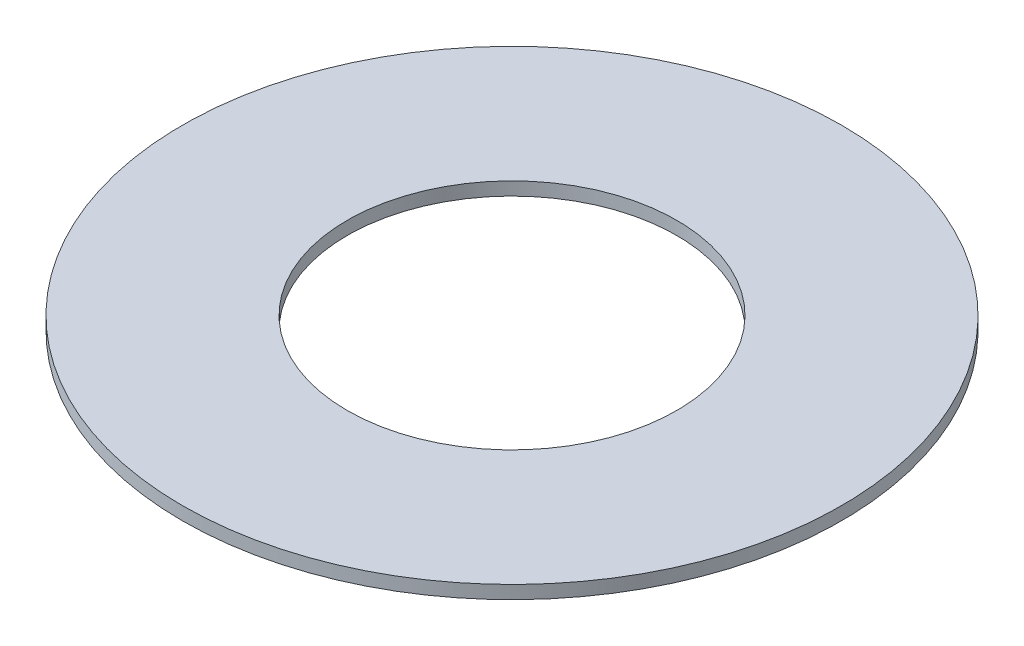
ISO-10303-21;
HEADER;
FILE_DESCRIPTION(('STEP AP214'),'2;1');
FILE_NAME('part.step','',(''),(''),'','','');
FILE_SCHEMA(('AUTOMOTIVE_DESIGN { 1 0 10303 214 1 1 1 1 }'));
ENDSEC;
DATA;
#1=APPLICATION_CONTEXT('core data for automotive mechanical design processes');
#2=APPLICATION_PROTOCOL_DEFINITION('international standard','automotive_design',2000,#1);
#3=PRODUCT_CONTEXT('',#1,'mechanical');
#4=PRODUCT('Part','Part','',(#3));
#5=PRODUCT_RELATED_PRODUCT_CATEGORY('part','',(#4));
#6=PRODUCT_DEFINITION_FORMATION('','',#4);
#7=PRODUCT_DEFINITION_CONTEXT('part definition',#1,'design');
#8=PRODUCT_DEFINITION('design','',#6,#7);
#9=PRODUCT_DEFINITION_SHAPE('','',#8);
#10=(LENGTH_UNIT() NAMED_UNIT(*) SI_UNIT(.MILLI.,.METRE.));
#11=(NAMED_UNIT(*) PLANE_ANGLE_UNIT() SI_UNIT($,.RADIAN.));
#12=(NAMED_UNIT(*) SI_UNIT($,.STERADIAN.) SOLID_ANGLE_UNIT());
#13=UNCERTAINTY_MEASURE_WITH_UNIT(LENGTH_MEASURE(1.E-05),#10,'distance_accuracy_value','');
#14=(GEOMETRIC_REPRESENTATION_CONTEXT(3) GLOBAL_UNCERTAINTY_ASSIGNED_CONTEXT((#13)) GLOBAL_UNIT_ASSIGNED_CONTEXT((#10,
#11,#12)) REPRESENTATION_CONTEXT('',''));
#15=CARTESIAN_POINT('',(0.,0.,0.));
#16=DIRECTION('',(0.,0.,1.));
#17=DIRECTION('',(1.,0.,0.));
#18=AXIS2_PLACEMENT_3D('',#15,#16,#17);
#19=CARTESIAN_POINT('',(0.,0.200000000000006,0.));
#20=DIRECTION('',(0.,1.,0.));
#21=DIRECTION('',(0.,0.,1.));
#22=AXIS2_PLACEMENT_3D('',#19,#20,#21);
#23=PLANE('',#22);
#24=CARTESIAN_POINT('',(0.,0.200000000000006,0.));
#25=DIRECTION('',(0.,-1.,0.));
#26=DIRECTION('',(0.,0.,-1.));
#27=AXIS2_PLACEMENT_3D('',#24,#25,#26);
#28=CIRCLE('',#27,5.);
#29=CARTESIAN_POINT('',(0.,0.200000000000006,-5.));
#30=VERTEX_POINT('',#29);
#31=EDGE_CURVE('E26',#30,#30,#28,.T.);
#32=ORIENTED_EDGE('',*,*,#31,.F.);
#33=EDGE_LOOP('',(#32));
#34=FACE_BOUND('',#33,.T.);
#35=CARTESIAN_POINT('',(0.,0.200000000000006,0.));
#36=DIRECTION('',(0.,1.,0.));
#37=DIRECTION('',(0.,0.,1.));
#38=AXIS2_PLACEMENT_3D('',#35,#36,#37);
#39=CIRCLE('',#38,2.5);
#40=CARTESIAN_POINT('',(0.,0.200000000000006,2.5));
#41=VERTEX_POINT('',#40);
#42=EDGE_CURVE('E17',#41,#41,#39,.F.);
#43=ORIENTED_EDGE('',*,*,#42,.T.);
#44=EDGE_LOOP('',(#43));
#45=FACE_BOUND('',#44,.T.);
#46=ADVANCED_FACE('F14',(#34,#45),#23,.T.);
#47=CARTESIAN_POINT('',(0.,0.,0.));
#48=DIRECTION('',(0.,1.,0.));
#49=DIRECTION('',(0.,0.,1.));
#50=AXIS2_PLACEMENT_3D('',#47,#48,#49);
#51=CYLINDRICAL_SURFACE('',#50,2.5);
#52=CARTESIAN_POINT('',(0.,0.,0.));
#53=DIRECTION('',(0.,1.,0.));
#54=DIRECTION('',(0.,0.,1.));
#55=AXIS2_PLACEMENT_3D('',#52,#53,#54);
#56=CIRCLE('',#55,2.5);
#57=CARTESIAN_POINT('',(0.,0.,2.5));
#58=VERTEX_POINT('',#57);
#59=EDGE_CURVE('E21',#58,#58,#56,.F.);
#60=ORIENTED_EDGE('',*,*,#59,.T.);
#61=EDGE_LOOP('',(#60));
#62=FACE_BOUND('',#61,.T.);
#63=ORIENTED_EDGE('',*,*,#42,.F.);
#64=EDGE_LOOP('',(#63));
#65=FACE_BOUND('',#64,.T.);
#66=ADVANCED_FACE('F35',(#62,#65),#51,.F.);
#67=CARTESIAN_POINT('',(0.,0.200000000000006,0.));
#68=DIRECTION('',(0.,-1.,0.));
#69=DIRECTION('',(0.,0.,-1.));
#70=AXIS2_PLACEMENT_3D('',#67,#68,#69);
#71=CYLINDRICAL_SURFACE('',#70,5.);
#72=ORIENTED_EDGE('',*,*,#31,.T.);
#73=EDGE_LOOP('',(#72));
#74=FACE_BOUND('',#73,.T.);
#75=CARTESIAN_POINT('',(0.,0.,0.));
#76=DIRECTION('',(0.,-1.,0.));
#77=DIRECTION('',(0.,0.,-1.));
#78=AXIS2_PLACEMENT_3D('',#75,#76,#77);
#79=CIRCLE('',#78,5.);
#80=CARTESIAN_POINT('',(0.,0.,-5.));
#81=VERTEX_POINT('',#80);
#82=EDGE_CURVE('E10',#81,#81,#79,.F.);
#83=ORIENTED_EDGE('',*,*,#82,.T.);
#84=EDGE_LOOP('',(#83));
#85=FACE_BOUND('',#84,.T.);
#86=ADVANCED_FACE('F37',(#74,#85),#71,.T.);
#87=CARTESIAN_POINT('',(0.,0.,0.));
#88=DIRECTION('',(0.,1.,0.));
#89=DIRECTION('',(0.,0.,1.));
#90=AXIS2_PLACEMENT_3D('',#87,#88,#89);
#91=PLANE('',#90);
#92=ORIENTED_EDGE('',*,*,#82,.F.);
#93=EDGE_LOOP('',(#92));
#94=FACE_BOUND('',#93,.T.);
#95=ORIENTED_EDGE('',*,*,#59,.F.);
#96=EDGE_LOOP('',(#95));
#97=FACE_BOUND('',#96,.T.);
#98=ADVANCED_FACE('F44',(#94,#97),#91,.F.);
#99=CLOSED_SHELL('',(#46,#66,#86,#98));
#100=MANIFOLD_SOLID_BREP('B1',#99);
#101=ADVANCED_BREP_SHAPE_REPRESENTATION('',(#18,#100),#14);
#102=SHAPE_DEFINITION_REPRESENTATION(#9,#101);
ENDSEC;
END-ISO-10303-21;
